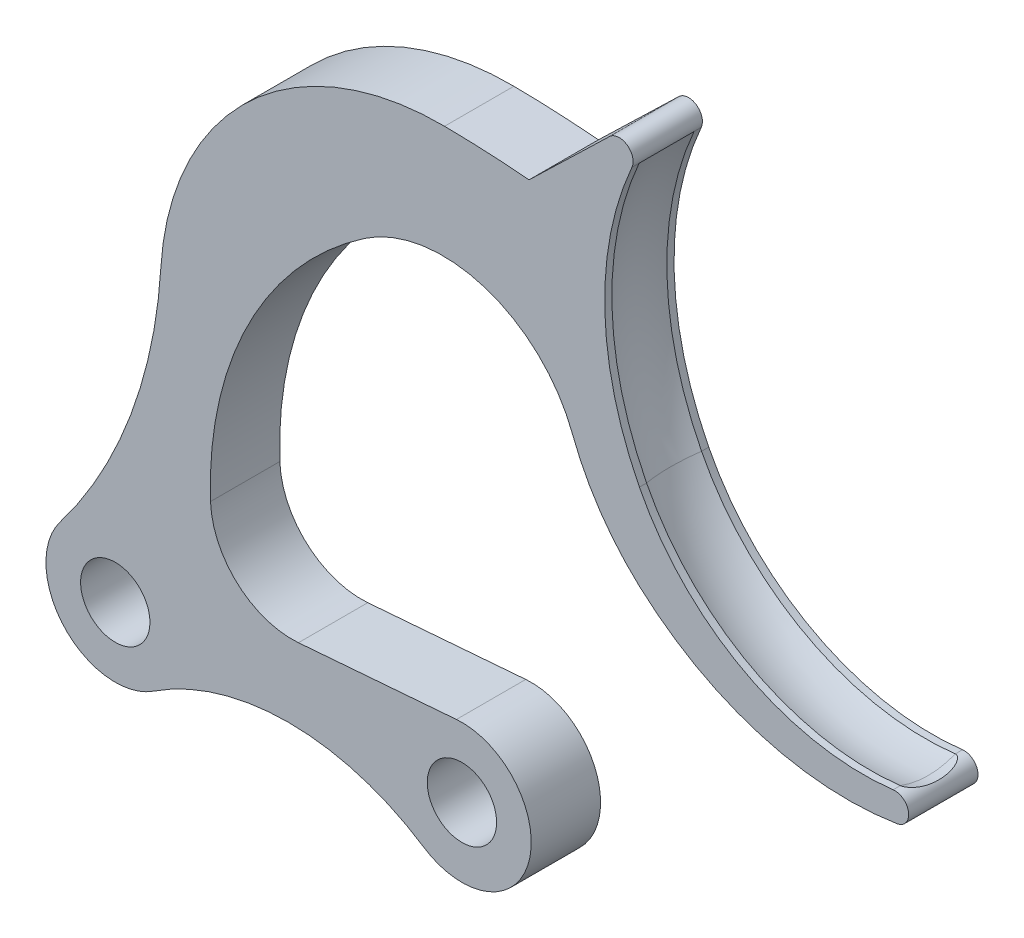
ISO-10303-21;
HEADER;
FILE_DESCRIPTION(('STEP AP214'),'2;1');
FILE_NAME('part.step','',(''),(''),'','','');
FILE_SCHEMA(('AUTOMOTIVE_DESIGN { 1 0 10303 214 1 1 1 1 }'));
ENDSEC;
DATA;
#1=APPLICATION_CONTEXT('core data for automotive mechanical design processes');
#2=APPLICATION_PROTOCOL_DEFINITION('international standard','automotive_design',2000,#1);
#3=PRODUCT_CONTEXT('',#1,'mechanical');
#4=PRODUCT('Part','Part','',(#3));
#5=PRODUCT_RELATED_PRODUCT_CATEGORY('part','',(#4));
#6=PRODUCT_DEFINITION_FORMATION('','',#4);
#7=PRODUCT_DEFINITION_CONTEXT('part definition',#1,'design');
#8=PRODUCT_DEFINITION('design','',#6,#7);
#9=PRODUCT_DEFINITION_SHAPE('','',#8);
#10=(LENGTH_UNIT() NAMED_UNIT(*) SI_UNIT(.MILLI.,.METRE.));
#11=(NAMED_UNIT(*) PLANE_ANGLE_UNIT() SI_UNIT($,.RADIAN.));
#12=(NAMED_UNIT(*) SI_UNIT($,.STERADIAN.) SOLID_ANGLE_UNIT());
#13=UNCERTAINTY_MEASURE_WITH_UNIT(LENGTH_MEASURE(1.E-05),#10,'distance_accuracy_value','');
#14=(GEOMETRIC_REPRESENTATION_CONTEXT(3) GLOBAL_UNCERTAINTY_ASSIGNED_CONTEXT((#13)) GLOBAL_UNIT_ASSIGNED_CONTEXT((#10,
#11,#12)) REPRESENTATION_CONTEXT('',''));
#15=CARTESIAN_POINT('',(0.,0.,0.));
#16=DIRECTION('',(0.,0.,1.));
#17=DIRECTION('',(1.,0.,0.));
#18=AXIS2_PLACEMENT_3D('',#15,#16,#17);
#19=CARTESIAN_POINT('',(58.2226825078013,36.5090543889675,-2.5));
#20=DIRECTION('',(0.,0.,1.));
#21=DIRECTION('',(1.,0.,0.));
#22=AXIS2_PLACEMENT_3D('',#19,#20,#21);
#23=CYLINDRICAL_SURFACE('',#22,22.9272942399541);
#24=DIRECTION('',(0.,0.,1.));
#25=VECTOR('',#24,1.);
#26=CARTESIAN_POINT('',(37.7991681713568,26.0907587839045,-2.5));
#27=LINE('',#26,#25);
#28=CARTESIAN_POINT('',(37.7991681713568,26.0907587839045,1.98204630208392));
#29=VERTEX_POINT('',#28);
#30=CARTESIAN_POINT('',(37.7991681713568,26.0907587839045,2.5));
#31=VERTEX_POINT('',#30);
#32=EDGE_CURVE('E211',#29,#31,#27,.T.);
#33=ORIENTED_EDGE('',*,*,#32,.F.);
#34=CARTESIAN_POINT('',(58.2226825078013,36.5090543889675,1.98204630208393));
#35=DIRECTION('',(0.,0.,-1.));
#36=DIRECTION('',(-1.,0.,0.));
#37=AXIS2_PLACEMENT_3D('',#34,#35,#36);
#38=CIRCLE('',#37,22.9272942399541);
#39=CARTESIAN_POINT('',(37.2578841277003,45.790113059569,1.98204630208393));
#40=VERTEX_POINT('',#39);
#41=EDGE_CURVE('E418',#29,#40,#38,.T.);
#42=ORIENTED_EDGE('',*,*,#41,.T.);
#43=DIRECTION('',(0.,0.,1.));
#44=VECTOR('',#43,1.);
#45=CARTESIAN_POINT('',(37.2578841277003,45.790113059569,-2.5));
#46=LINE('',#45,#44);
#47=CARTESIAN_POINT('',(37.2578841277003,45.790113059569,2.5));
#48=VERTEX_POINT('',#47);
#49=EDGE_CURVE('E398',#40,#48,#46,.T.);
#50=ORIENTED_EDGE('',*,*,#49,.T.);
#51=CARTESIAN_POINT('',(58.2226825078013,36.5090543889675,2.5));
#52=DIRECTION('',(0.,0.,-1.));
#53=DIRECTION('',(1.,0.,0.));
#54=AXIS2_PLACEMENT_3D('',#51,#52,#53);
#55=CIRCLE('',#54,22.9272942399541);
#56=EDGE_CURVE('E390',#31,#48,#55,.T.);
#57=ORIENTED_EDGE('',*,*,#56,.F.);
#58=EDGE_LOOP('',(#33,#42,#50,#57));
#59=FACE_BOUND('',#58,.T.);
#60=ADVANCED_FACE('F38',(#59),#23,.F.);
#61=CARTESIAN_POINT('',(37.2578841277003,45.790113059569,-2.5));
#62=VERTEX_POINT('',#61);
#63=CARTESIAN_POINT('',(37.2578841277003,45.790113059569,-1.98204630208393));
#64=VERTEX_POINT('',#63);
#65=EDGE_CURVE('E395',#62,#64,#46,.T.);
#66=ORIENTED_EDGE('',*,*,#65,.T.);
#67=CARTESIAN_POINT('',(58.2226825078013,36.5090543889675,-1.98204630208393));
#68=DIRECTION('',(0.,0.,1.));
#69=DIRECTION('',(1.,0.,0.));
#70=AXIS2_PLACEMENT_3D('',#67,#68,#69);
#71=CIRCLE('',#70,22.9272942399541);
#72=CARTESIAN_POINT('',(37.7991681713568,26.0907587839045,-1.98204630208392));
#73=VERTEX_POINT('',#72);
#74=EDGE_CURVE('E203',#64,#73,#71,.T.);
#75=ORIENTED_EDGE('',*,*,#74,.T.);
#76=CARTESIAN_POINT('',(37.7991681713568,26.0907587839045,-2.5));
#77=VERTEX_POINT('',#76);
#78=EDGE_CURVE('E215',#77,#73,#27,.T.);
#79=ORIENTED_EDGE('',*,*,#78,.F.);
#80=CARTESIAN_POINT('',(58.2226825078013,36.5090543889675,-2.5));
#81=DIRECTION('',(0.,0.,-1.));
#82=DIRECTION('',(1.,0.,0.));
#83=AXIS2_PLACEMENT_3D('',#80,#81,#82);
#84=CIRCLE('',#83,22.9272942399541);
#85=EDGE_CURVE('E422',#77,#62,#84,.T.);
#86=ORIENTED_EDGE('',*,*,#85,.T.);
#87=EDGE_LOOP('',(#66,#75,#79,#86));
#88=FACE_BOUND('',#87,.T.);
#89=ADVANCED_FACE('F337',(#88),#23,.F.);
#90=CARTESIAN_POINT('',(53.9314135044685,34.3200232427565,-2.5));
#91=DIRECTION('',(0.,0.,1.));
#92=DIRECTION('',(1.,0.,0.));
#93=AXIS2_PLACEMENT_3D('',#90,#91,#92);
#94=CYLINDRICAL_SURFACE('',#93,18.1099456934975);
#95=DIRECTION('',(0.,0.,1.));
#96=VECTOR('',#95,1.);
#97=CARTESIAN_POINT('',(56.0998806077633,16.3403713149978,-2.5));
#98=LINE('',#97,#96);
#99=CARTESIAN_POINT('',(56.0998806077633,16.3403713149978,1.98204630208393));
#100=VERTEX_POINT('',#99);
#101=CARTESIAN_POINT('',(56.0998806077633,16.3403713149978,2.5));
#102=VERTEX_POINT('',#101);
#103=EDGE_CURVE('E190',#100,#102,#98,.T.);
#104=ORIENTED_EDGE('',*,*,#103,.F.);
#105=CARTESIAN_POINT('',(53.9314135044685,34.3200232427565,1.98204630208392));
#106=DIRECTION('',(0.,0.,-1.));
#107=DIRECTION('',(-1.,0.,0.));
#108=AXIS2_PLACEMENT_3D('',#105,#106,#107);
#109=CIRCLE('',#108,18.1099456934975);
#110=EDGE_CURVE('E198',#100,#29,#109,.T.);
#111=ORIENTED_EDGE('',*,*,#110,.T.);
#112=ORIENTED_EDGE('',*,*,#32,.T.);
#113=CARTESIAN_POINT('',(53.9314135044685,34.3200232427565,2.5));
#114=DIRECTION('',(0.,0.,-1.));
#115=DIRECTION('',(1.,0.,0.));
#116=AXIS2_PLACEMENT_3D('',#113,#114,#115);
#117=CIRCLE('',#116,18.1099456934975);
#118=EDGE_CURVE('E207',#102,#31,#117,.T.);
#119=ORIENTED_EDGE('',*,*,#118,.F.);
#120=EDGE_LOOP('',(#104,#111,#112,#119));
#121=FACE_BOUND('',#120,.T.);
#122=ADVANCED_FACE('F205',(#121),#94,.F.);
#123=ORIENTED_EDGE('',*,*,#78,.T.);
#124=CARTESIAN_POINT('',(53.9314135044685,34.3200232427565,-1.98204630208392));
#125=DIRECTION('',(0.,0.,1.));
#126=DIRECTION('',(1.,0.,0.));
#127=AXIS2_PLACEMENT_3D('',#124,#125,#126);
#128=CIRCLE('',#127,18.1099456934975);
#129=CARTESIAN_POINT('',(56.0998806077633,16.3403713149978,-1.98204630208393));
#130=VERTEX_POINT('',#129);
#131=EDGE_CURVE('E182',#73,#130,#128,.T.);
#132=ORIENTED_EDGE('',*,*,#131,.T.);
#133=CARTESIAN_POINT('',(56.0998806077633,16.3403713149978,-2.5));
#134=VERTEX_POINT('',#133);
#135=EDGE_CURVE('E193',#134,#130,#98,.T.);
#136=ORIENTED_EDGE('',*,*,#135,.F.);
#137=CARTESIAN_POINT('',(53.9314135044685,34.3200232427565,-2.5));
#138=DIRECTION('',(0.,0.,-1.));
#139=DIRECTION('',(1.,0.,0.));
#140=AXIS2_PLACEMENT_3D('',#137,#138,#139);
#141=CIRCLE('',#140,18.1099456934975);
#142=EDGE_CURVE('E424',#134,#77,#141,.T.);
#143=ORIENTED_EDGE('',*,*,#142,.T.);
#144=EDGE_LOOP('',(#123,#132,#136,#143));
#145=FACE_BOUND('',#144,.T.);
#146=ADVANCED_FACE('F350',(#145),#94,.F.);
#147=CARTESIAN_POINT('',(0.,0.,2.5));
#148=DIRECTION('',(0.,0.,1.));
#149=DIRECTION('',(1.,0.,0.));
#150=AXIS2_PLACEMENT_3D('',#147,#148,#149);
#151=PLANE('',#150);
#152=CARTESIAN_POINT('',(25.,0.,2.5));
#153=DIRECTION('',(0.,0.,1.));
#154=DIRECTION('',(1.,0.,0.));
#155=AXIS2_PLACEMENT_3D('',#152,#153,#154);
#156=CIRCLE('',#155,2.5);
#157=CARTESIAN_POINT('',(27.5,0.,2.5));
#158=VERTEX_POINT('',#157);
#159=EDGE_CURVE('E289',#158,#158,#156,.T.);
#160=ORIENTED_EDGE('',*,*,#159,.F.);
#161=EDGE_LOOP('',(#160));
#162=FACE_BOUND('',#161,.T.);
#163=CARTESIAN_POINT('',(0.,0.,2.5));
#164=DIRECTION('',(0.,0.,1.));
#165=DIRECTION('',(1.,0.,0.));
#166=AXIS2_PLACEMENT_3D('',#163,#164,#165);
#167=CIRCLE('',#166,2.5);
#168=CARTESIAN_POINT('',(2.5,0.,2.5));
#169=VERTEX_POINT('',#168);
#170=EDGE_CURVE('E283',#169,#169,#167,.T.);
#171=ORIENTED_EDGE('',*,*,#170,.F.);
#172=EDGE_LOOP('',(#171));
#173=FACE_BOUND('',#172,.T.);
#174=CARTESIAN_POINT('',(25.,0.,2.5));
#175=DIRECTION('',(0.,0.,1.));
#176=DIRECTION('',(1.,0.,0.));
#177=AXIS2_PLACEMENT_3D('',#174,#175,#176);
#178=CIRCLE('',#177,5.);
#179=CARTESIAN_POINT('',(22.2497709928489,-4.17567244982466,2.5));
#180=VERTEX_POINT('',#179);
#181=CARTESIAN_POINT('',(24.6042547545765,4.98431396490277,2.5));
#182=VERTEX_POINT('',#181);
#183=EDGE_CURVE('E297',#180,#182,#178,.T.);
#184=ORIENTED_EDGE('',*,*,#183,.T.);
#185=DIRECTION('',(-0.996862792980552,-0.0791490490847025,0.));
#186=VECTOR('',#185,1.);
#187=CARTESIAN_POINT('',(13.2101842834548,4.079645991192,2.5));
#188=LINE('',#187,#186);
#189=CARTESIAN_POINT('',(13.2101842834548,4.07964599119199,2.5));
#190=VERTEX_POINT('',#189);
#191=EDGE_CURVE('E250',#182,#190,#188,.T.);
#192=ORIENTED_EDGE('',*,*,#191,.T.);
#193=CARTESIAN_POINT('',(12.7448377193228,9.9405714348829,2.5));
#194=DIRECTION('',(0.,0.,-1.));
#195=DIRECTION('',(1.,0.,0.));
#196=AXIS2_PLACEMENT_3D('',#193,#194,#195);
#197=CIRCLE('',#196,5.87937024529438);
#198=CARTESIAN_POINT('',(6.86933476984612,9.72735893069197,2.5));
#199=VERTEX_POINT('',#198);
#200=EDGE_CURVE('E253',#190,#199,#197,.T.);
#201=ORIENTED_EDGE('',*,*,#200,.T.);
#202=CARTESIAN_POINT('',(32.353978900582,10.6521554698567,2.5));
#203=DIRECTION('',(0.,0.,-1.));
#204=DIRECTION('',(-1.,0.,0.));
#205=AXIS2_PLACEMENT_3D('',#202,#203,#204);
#206=CIRCLE('',#205,25.5014182960301);
#207=CARTESIAN_POINT('',(17.9857844126222,31.7205517606346,2.5));
#208=VERTEX_POINT('',#207);
#209=EDGE_CURVE('E256',#199,#208,#206,.T.);
#210=ORIENTED_EDGE('',*,*,#209,.T.);
#211=CARTESIAN_POINT('',(23.6200571111711,23.4588950769914,2.5));
#212=DIRECTION('',(0.,0.,1.));
#213=DIRECTION('',(1.,0.,0.));
#214=AXIS2_PLACEMENT_3D('',#211,#212,#213);
#215=CIRCLE('',#214,10.);
#216=CARTESIAN_POINT('',(32.9709637978927,27.0029808739529,2.5));
#217=VERTEX_POINT('',#216);
#218=EDGE_CURVE('E46',#208,#217,#215,.F.);
#219=ORIENTED_EDGE('',*,*,#218,.T.);
#220=CARTESIAN_POINT('',(50.2240589299429,33.5420739757967,2.5));
#221=DIRECTION('',(0.,0.,1.));
#222=DIRECTION('',(1.,0.,0.));
#223=AXIS2_PLACEMENT_3D('',#220,#221,#222);
#224=CIRCLE('',#223,18.4507189624187);
#225=CARTESIAN_POINT('',(37.7991681713567,19.9020182622977,2.5));
#226=VERTEX_POINT('',#225);
#227=EDGE_CURVE('E416',#217,#226,#224,.T.);
#228=ORIENTED_EDGE('',*,*,#227,.T.);
#229=CARTESIAN_POINT('',(52.8405731795773,36.4144855594167,2.5));
#230=DIRECTION('',(0.,0.,1.));
#231=DIRECTION('',(1.,0.,0.));
#232=AXIS2_PLACEMENT_3D('',#229,#230,#231);
#233=CIRCLE('',#232,22.3361912791717);
#234=CARTESIAN_POINT('',(56.3779912109044,14.3601863293032,2.5));
#235=VERTEX_POINT('',#234);
#236=EDGE_CURVE('E412',#226,#235,#233,.T.);
#237=ORIENTED_EDGE('',*,*,#236,.T.);
#238=CARTESIAN_POINT('',(56.2196196252068,15.3475659122618,2.5));
#239=DIRECTION('',(0.,0.,1.));
#240=DIRECTION('',(-1.,0.,0.));
#241=AXIS2_PLACEMENT_3D('',#238,#239,#240);
#242=CIRCLE('',#241,0.999999999999997);
#243=EDGE_CURVE('E410',#235,#102,#242,.T.);
#244=ORIENTED_EDGE('',*,*,#243,.T.);
#245=ORIENTED_EDGE('',*,*,#118,.T.);
#246=ORIENTED_EDGE('',*,*,#56,.T.);
#247=CARTESIAN_POINT('',(36.3434806154199,46.1949169833756,2.5));
#248=DIRECTION('',(0.,0.,1.));
#249=DIRECTION('',(-1.,0.,0.));
#250=AXIS2_PLACEMENT_3D('',#247,#248,#249);
#251=CIRCLE('',#250,1.);
#252=CARTESIAN_POINT('',(35.648712262663,46.9141505587928,2.5));
#253=VERTEX_POINT('',#252);
#254=EDGE_CURVE('E386',#48,#253,#251,.T.);
#255=ORIENTED_EDGE('',*,*,#254,.T.);
#256=DIRECTION('',(-0.719233575417234,-0.694768352756904,0.));
#257=VECTOR('',#256,1.);
#258=CARTESIAN_POINT('',(29.8436703148365,41.3065710886096,2.5));
#259=LINE('',#258,#257);
#260=CARTESIAN_POINT('',(29.8436703148365,41.3065710886096,2.5));
#261=VERTEX_POINT('',#260);
#262=EDGE_CURVE('E380',#253,#261,#259,.T.);
#263=ORIENTED_EDGE('',*,*,#262,.T.);
#264=CARTESIAN_POINT('',(22.9439482129142,-37.444832821864,2.5));
#265=DIRECTION('',(0.,0.,1.));
#266=DIRECTION('',(-1.,0.,0.));
#267=AXIS2_PLACEMENT_3D('',#264,#265,#266);
#268=CIRCLE('',#267,79.0530820585404);
#269=CARTESIAN_POINT('',(23.7481849093968,41.6041582298271,2.5));
#270=VERTEX_POINT('',#269);
#271=EDGE_CURVE('E258',#261,#270,#268,.T.);
#272=ORIENTED_EDGE('',*,*,#271,.T.);
#273=CARTESIAN_POINT('',(23.5417487744683,21.3134052039131,2.5));
#274=DIRECTION('',(0.,0.,1.));
#275=DIRECTION('',(-1.,0.,0.));
#276=AXIS2_PLACEMENT_3D('',#273,#274,#275);
#277=CIRCLE('',#276,20.291803129255);
#278=CARTESIAN_POINT('',(3.28714861794059,22.5415935997336,2.5));
#279=VERTEX_POINT('',#278);
#280=EDGE_CURVE('E225',#270,#279,#277,.T.);
#281=ORIENTED_EDGE('',*,*,#280,.T.);
#282=CARTESIAN_POINT('',(-32.3525928679536,24.702698562791,2.5));
#283=DIRECTION('',(0.,0.,-1.));
#284=DIRECTION('',(-1.,0.,0.));
#285=AXIS2_PLACEMENT_3D('',#282,#283,#284);
#286=CIRCLE('',#285,35.7052033720958);
#287=CARTESIAN_POINT('',(-3.97401194292178,3.03434162175506,2.5));
#288=VERTEX_POINT('',#287);
#289=EDGE_CURVE('E243',#279,#288,#286,.T.);
#290=ORIENTED_EDGE('',*,*,#289,.T.);
#291=CARTESIAN_POINT('',(0.,0.,2.5));
#292=DIRECTION('',(0.,0.,1.));
#293=DIRECTION('',(1.,0.,0.));
#294=AXIS2_PLACEMENT_3D('',#291,#292,#293);
#295=CIRCLE('',#294,5.);
#296=CARTESIAN_POINT('',(2.75022900715111,-4.17567244982466,2.5));
#297=VERTEX_POINT('',#296);
#298=EDGE_CURVE('E295',#288,#297,#295,.T.);
#299=ORIENTED_EDGE('',*,*,#298,.T.);
#300=CARTESIAN_POINT('',(12.5,-18.9787488558549,2.5));
#301=DIRECTION('',(0.,0.,-1.));
#302=DIRECTION('',(-1.,0.,0.));
#303=AXIS2_PLACEMENT_3D('',#300,#301,#302);
#304=CIRCLE('',#303,17.7253802637847);
#305=EDGE_CURVE('E246',#297,#180,#304,.T.);
#306=ORIENTED_EDGE('',*,*,#305,.T.);
#307=EDGE_LOOP('',(#184,#192,#201,#210,#219,#228,#237,#244,#245,#246,#255,#263,#272,#281,#290,
#299,#306));
#308=FACE_BOUND('',#307,.T.);
#309=ADVANCED_FACE('F312',(#162,#173,#308),#151,.T.);
#310=CARTESIAN_POINT('',(0.,0.,-2.5));
#311=DIRECTION('',(0.,0.,1.));
#312=DIRECTION('',(1.,0.,0.));
#313=AXIS2_PLACEMENT_3D('',#310,#311,#312);
#314=PLANE('',#313);
#315=CARTESIAN_POINT('',(25.,0.,-2.5));
#316=DIRECTION('',(0.,0.,1.));
#317=DIRECTION('',(1.,0.,0.));
#318=AXIS2_PLACEMENT_3D('',#315,#316,#317);
#319=CIRCLE('',#318,2.5);
#320=CARTESIAN_POINT('',(27.5,0.,-2.5));
#321=VERTEX_POINT('',#320);
#322=EDGE_CURVE('E286',#321,#321,#319,.T.);
#323=ORIENTED_EDGE('',*,*,#322,.T.);
#324=EDGE_LOOP('',(#323));
#325=FACE_BOUND('',#324,.T.);
#326=CARTESIAN_POINT('',(0.,0.,-2.5));
#327=DIRECTION('',(0.,0.,1.));
#328=DIRECTION('',(1.,0.,0.));
#329=AXIS2_PLACEMENT_3D('',#326,#327,#328);
#330=CIRCLE('',#329,2.5);
#331=CARTESIAN_POINT('',(2.5,0.,-2.5));
#332=VERTEX_POINT('',#331);
#333=EDGE_CURVE('E264',#332,#332,#330,.T.);
#334=ORIENTED_EDGE('',*,*,#333,.T.);
#335=EDGE_LOOP('',(#334));
#336=FACE_BOUND('',#335,.T.);
#337=DIRECTION('',(-0.996862792980552,-0.0791490490847025,0.));
#338=VECTOR('',#337,1.);
#339=CARTESIAN_POINT('',(13.2101842834548,4.079645991192,-2.5));
#340=LINE('',#339,#338);
#341=CARTESIAN_POINT('',(24.6042547545765,4.98431396490277,-2.5));
#342=VERTEX_POINT('',#341);
#343=CARTESIAN_POINT('',(13.2101842834548,4.07964599119199,-2.5));
#344=VERTEX_POINT('',#343);
#345=EDGE_CURVE('E228',#342,#344,#340,.T.);
#346=ORIENTED_EDGE('',*,*,#345,.F.);
#347=CARTESIAN_POINT('',(25.,0.,-2.5));
#348=DIRECTION('',(0.,0.,1.));
#349=DIRECTION('',(1.,0.,0.));
#350=AXIS2_PLACEMENT_3D('',#347,#348,#349);
#351=CIRCLE('',#350,5.);
#352=CARTESIAN_POINT('',(22.2497709928489,-4.17567244982466,-2.5));
#353=VERTEX_POINT('',#352);
#354=EDGE_CURVE('E298',#353,#342,#351,.T.);
#355=ORIENTED_EDGE('',*,*,#354,.F.);
#356=CARTESIAN_POINT('',(12.5,-18.9787488558549,-2.5));
#357=DIRECTION('',(0.,0.,-1.));
#358=DIRECTION('',(-1.,0.,0.));
#359=AXIS2_PLACEMENT_3D('',#356,#357,#358);
#360=CIRCLE('',#359,17.7253802637847);
#361=CARTESIAN_POINT('',(2.75022900715111,-4.17567244982466,-2.5));
#362=VERTEX_POINT('',#361);
#363=EDGE_CURVE('E224',#362,#353,#360,.T.);
#364=ORIENTED_EDGE('',*,*,#363,.F.);
#365=CARTESIAN_POINT('',(0.,0.,-2.5));
#366=DIRECTION('',(0.,0.,1.));
#367=DIRECTION('',(1.,0.,0.));
#368=AXIS2_PLACEMENT_3D('',#365,#366,#367);
#369=CIRCLE('',#368,5.);
#370=CARTESIAN_POINT('',(-3.97401194292178,3.03434162175506,-2.5));
#371=VERTEX_POINT('',#370);
#372=EDGE_CURVE('E292',#371,#362,#369,.T.);
#373=ORIENTED_EDGE('',*,*,#372,.F.);
#374=CARTESIAN_POINT('',(-32.3525928679536,24.702698562791,-2.5));
#375=DIRECTION('',(0.,0.,-1.));
#376=DIRECTION('',(-1.,0.,0.));
#377=AXIS2_PLACEMENT_3D('',#374,#375,#376);
#378=CIRCLE('',#377,35.7052033720958);
#379=CARTESIAN_POINT('',(3.28714861794059,22.5415935997336,-2.5));
#380=VERTEX_POINT('',#379);
#381=EDGE_CURVE('E221',#380,#371,#378,.T.);
#382=ORIENTED_EDGE('',*,*,#381,.F.);
#383=CARTESIAN_POINT('',(23.5417487744683,21.3134052039131,-2.5));
#384=DIRECTION('',(0.,0.,1.));
#385=DIRECTION('',(-1.,0.,0.));
#386=AXIS2_PLACEMENT_3D('',#383,#384,#385);
#387=CIRCLE('',#386,20.291803129255);
#388=CARTESIAN_POINT('',(23.7481849093968,41.6041582298271,-2.5));
#389=VERTEX_POINT('',#388);
#390=EDGE_CURVE('E239',#389,#380,#387,.T.);
#391=ORIENTED_EDGE('',*,*,#390,.F.);
#392=CARTESIAN_POINT('',(22.9439482129142,-37.444832821864,-2.5));
#393=DIRECTION('',(0.,0.,1.));
#394=DIRECTION('',(-1.,0.,0.));
#395=AXIS2_PLACEMENT_3D('',#392,#393,#394);
#396=CIRCLE('',#395,79.0530820585404);
#397=CARTESIAN_POINT('',(29.8436703148365,41.3065710886096,-2.5));
#398=VERTEX_POINT('',#397);
#399=EDGE_CURVE('E237',#398,#389,#396,.T.);
#400=ORIENTED_EDGE('',*,*,#399,.F.);
#401=DIRECTION('',(-0.719233575417234,-0.694768352756904,0.));
#402=VECTOR('',#401,1.);
#403=CARTESIAN_POINT('',(29.8436703148365,41.3065710886096,-2.5));
#404=LINE('',#403,#402);
#405=CARTESIAN_POINT('',(35.648712262663,46.9141505587928,-2.5));
#406=VERTEX_POINT('',#405);
#407=EDGE_CURVE('E220',#406,#398,#404,.T.);
#408=ORIENTED_EDGE('',*,*,#407,.F.);
#409=CARTESIAN_POINT('',(36.3434806154199,46.1949169833756,-2.5));
#410=DIRECTION('',(0.,0.,1.));
#411=DIRECTION('',(-1.,0.,0.));
#412=AXIS2_PLACEMENT_3D('',#409,#410,#411);
#413=CIRCLE('',#412,1.);
#414=EDGE_CURVE('E420',#62,#406,#413,.T.);
#415=ORIENTED_EDGE('',*,*,#414,.F.);
#416=ORIENTED_EDGE('',*,*,#85,.F.);
#417=ORIENTED_EDGE('',*,*,#142,.F.);
#418=CARTESIAN_POINT('',(56.2196196252068,15.3475659122618,-2.5));
#419=DIRECTION('',(0.,0.,1.));
#420=DIRECTION('',(-1.,0.,0.));
#421=AXIS2_PLACEMENT_3D('',#418,#419,#420);
#422=CIRCLE('',#421,0.999999999999997);
#423=CARTESIAN_POINT('',(56.3779912109044,14.3601863293032,-2.5));
#424=VERTEX_POINT('',#423);
#425=EDGE_CURVE('E426',#424,#134,#422,.T.);
#426=ORIENTED_EDGE('',*,*,#425,.F.);
#427=CARTESIAN_POINT('',(52.8405731795773,36.4144855594167,-2.5));
#428=DIRECTION('',(0.,0.,1.));
#429=DIRECTION('',(1.,0.,0.));
#430=AXIS2_PLACEMENT_3D('',#427,#428,#429);
#431=CIRCLE('',#430,22.3361912791717);
#432=CARTESIAN_POINT('',(37.7991681713567,19.9020182622977,-2.5));
#433=VERTEX_POINT('',#432);
#434=EDGE_CURVE('E388',#433,#424,#431,.T.);
#435=ORIENTED_EDGE('',*,*,#434,.F.);
#436=CARTESIAN_POINT('',(50.2240589299429,33.5420739757967,-2.5));
#437=DIRECTION('',(0.,0.,1.));
#438=DIRECTION('',(1.,0.,0.));
#439=AXIS2_PLACEMENT_3D('',#436,#437,#438);
#440=CIRCLE('',#439,18.4507189624187);
#441=CARTESIAN_POINT('',(32.9709637978927,27.0029808739529,-2.5));
#442=VERTEX_POINT('',#441);
#443=EDGE_CURVE('E322',#442,#433,#440,.T.);
#444=ORIENTED_EDGE('',*,*,#443,.F.);
#445=CARTESIAN_POINT('',(23.6200571111711,23.4588950769914,-2.5));
#446=DIRECTION('',(0.,0.,1.));
#447=DIRECTION('',(1.,0.,0.));
#448=AXIS2_PLACEMENT_3D('',#445,#446,#447);
#449=CIRCLE('',#448,10.);
#450=CARTESIAN_POINT('',(17.9857844126222,31.7205517606346,-2.5));
#451=VERTEX_POINT('',#450);
#452=EDGE_CURVE('E12',#442,#451,#449,.T.);
#453=ORIENTED_EDGE('',*,*,#452,.T.);
#454=CARTESIAN_POINT('',(32.353978900582,10.6521554698567,-2.5));
#455=DIRECTION('',(0.,0.,-1.));
#456=DIRECTION('',(-1.,0.,0.));
#457=AXIS2_PLACEMENT_3D('',#454,#455,#456);
#458=CIRCLE('',#457,25.5014182960301);
#459=CARTESIAN_POINT('',(6.86933476984612,9.72735893069197,-2.5));
#460=VERTEX_POINT('',#459);
#461=EDGE_CURVE('E234',#460,#451,#458,.T.);
#462=ORIENTED_EDGE('',*,*,#461,.F.);
#463=CARTESIAN_POINT('',(12.7448377193228,9.9405714348829,-2.5));
#464=DIRECTION('',(0.,0.,-1.));
#465=DIRECTION('',(1.,0.,0.));
#466=AXIS2_PLACEMENT_3D('',#463,#464,#465);
#467=CIRCLE('',#466,5.87937024529438);
#468=EDGE_CURVE('E231',#344,#460,#467,.T.);
#469=ORIENTED_EDGE('',*,*,#468,.F.);
#470=EDGE_LOOP('',(#346,#355,#364,#373,#382,#391,#400,#408,#415,#416,#417,#426,#435,#444,#453,
#462,#469));
#471=FACE_BOUND('',#470,.T.);
#472=ADVANCED_FACE('F320',(#325,#336,#471),#314,.F.);
#473=CARTESIAN_POINT('',(0.,0.,2.5));
#474=DIRECTION('',(0.,0.,-1.));
#475=DIRECTION('',(-1.,0.,0.));
#476=AXIS2_PLACEMENT_3D('',#473,#474,#475);
#477=CYLINDRICAL_SURFACE('',#476,5.);
#478=ORIENTED_EDGE('',*,*,#372,.T.);
#479=DIRECTION('',(0.,0.,1.));
#480=VECTOR('',#479,1.);
#481=CARTESIAN_POINT('',(2.75022900715111,-4.17567244982466,-2.5));
#482=LINE('',#481,#480);
#483=EDGE_CURVE('E278',#362,#297,#482,.T.);
#484=ORIENTED_EDGE('',*,*,#483,.T.);
#485=ORIENTED_EDGE('',*,*,#298,.F.);
#486=DIRECTION('',(0.,0.,1.));
#487=VECTOR('',#486,1.);
#488=CARTESIAN_POINT('',(-3.97401194292178,3.03434162175506,-2.5));
#489=LINE('',#488,#487);
#490=EDGE_CURVE('E242',#371,#288,#489,.T.);
#491=ORIENTED_EDGE('',*,*,#490,.F.);
#492=EDGE_LOOP('',(#478,#484,#485,#491));
#493=FACE_BOUND('',#492,.T.);
#494=ADVANCED_FACE('F452',(#493),#477,.T.);
#495=CARTESIAN_POINT('',(25.,0.,2.5));
#496=DIRECTION('',(0.,0.,-1.));
#497=DIRECTION('',(-1.,0.,0.));
#498=AXIS2_PLACEMENT_3D('',#495,#496,#497);
#499=CYLINDRICAL_SURFACE('',#498,5.);
#500=ORIENTED_EDGE('',*,*,#354,.T.);
#501=DIRECTION('',(0.,0.,1.));
#502=VECTOR('',#501,1.);
#503=CARTESIAN_POINT('',(24.6042547545765,4.98431396490277,-2.5));
#504=LINE('',#503,#502);
#505=EDGE_CURVE('E272',#342,#182,#504,.T.);
#506=ORIENTED_EDGE('',*,*,#505,.T.);
#507=ORIENTED_EDGE('',*,*,#183,.F.);
#508=DIRECTION('',(0.,0.,1.));
#509=VECTOR('',#508,1.);
#510=CARTESIAN_POINT('',(22.2497709928489,-4.17567244982466,-2.5));
#511=LINE('',#510,#509);
#512=EDGE_CURVE('E275',#353,#180,#511,.T.);
#513=ORIENTED_EDGE('',*,*,#512,.F.);
#514=EDGE_LOOP('',(#500,#506,#507,#513));
#515=FACE_BOUND('',#514,.T.);
#516=ADVANCED_FACE('F458',(#515),#499,.T.);
#517=CARTESIAN_POINT('',(25.,0.,2.5));
#518=DIRECTION('',(0.,0.,-1.));
#519=DIRECTION('',(-1.,0.,0.));
#520=AXIS2_PLACEMENT_3D('',#517,#518,#519);
#521=CYLINDRICAL_SURFACE('',#520,2.5);
#522=ORIENTED_EDGE('',*,*,#159,.T.);
#523=EDGE_LOOP('',(#522));
#524=FACE_BOUND('',#523,.T.);
#525=ORIENTED_EDGE('',*,*,#322,.F.);
#526=EDGE_LOOP('',(#525));
#527=FACE_BOUND('',#526,.T.);
#528=ADVANCED_FACE('F470',(#524,#527),#521,.F.);
#529=CARTESIAN_POINT('',(0.,0.,2.5));
#530=DIRECTION('',(0.,0.,-1.));
#531=DIRECTION('',(-1.,0.,0.));
#532=AXIS2_PLACEMENT_3D('',#529,#530,#531);
#533=CYLINDRICAL_SURFACE('',#532,2.5);
#534=ORIENTED_EDGE('',*,*,#170,.T.);
#535=EDGE_LOOP('',(#534));
#536=FACE_BOUND('',#535,.T.);
#537=ORIENTED_EDGE('',*,*,#333,.F.);
#538=EDGE_LOOP('',(#537));
#539=FACE_BOUND('',#538,.T.);
#540=ADVANCED_FACE('F463',(#536,#539),#533,.F.);
#541=CARTESIAN_POINT('',(13.2101842834548,4.079645991192,-2.5));
#542=DIRECTION('',(-0.0791490490847025,0.996862792980552,0.));
#543=DIRECTION('',(-0.996862792980552,-0.0791490490847025,0.));
#544=AXIS2_PLACEMENT_3D('',#541,#542,#543);
#545=PLANE('',#544);
#546=ORIENTED_EDGE('',*,*,#191,.F.);
#547=ORIENTED_EDGE('',*,*,#505,.F.);
#548=ORIENTED_EDGE('',*,*,#345,.T.);
#549=DIRECTION('',(0.,0.,1.));
#550=VECTOR('',#549,1.);
#551=CARTESIAN_POINT('',(13.2101842834548,4.07964599119199,-2.5));
#552=LINE('',#551,#550);
#553=EDGE_CURVE('E270',#344,#190,#552,.T.);
#554=ORIENTED_EDGE('',*,*,#553,.T.);
#555=EDGE_LOOP('',(#546,#547,#548,#554));
#556=FACE_BOUND('',#555,.T.);
#557=ADVANCED_FACE('F461',(#556),#545,.T.);
#558=CARTESIAN_POINT('',(12.7448377193228,9.9405714348829,-2.5));
#559=DIRECTION('',(0.,0.,1.));
#560=DIRECTION('',(1.,0.,0.));
#561=AXIS2_PLACEMENT_3D('',#558,#559,#560);
#562=CYLINDRICAL_SURFACE('',#561,5.87937024529438);
#563=ORIENTED_EDGE('',*,*,#200,.F.);
#564=ORIENTED_EDGE('',*,*,#553,.F.);
#565=ORIENTED_EDGE('',*,*,#468,.T.);
#566=DIRECTION('',(0.,0.,1.));
#567=VECTOR('',#566,1.);
#568=CARTESIAN_POINT('',(6.86933476984612,9.72735893069197,-2.5));
#569=LINE('',#568,#567);
#570=EDGE_CURVE('E268',#460,#199,#569,.T.);
#571=ORIENTED_EDGE('',*,*,#570,.T.);
#572=EDGE_LOOP('',(#563,#564,#565,#571));
#573=FACE_BOUND('',#572,.T.);
#574=ADVANCED_FACE('F316',(#573),#562,.F.);
#575=CARTESIAN_POINT('',(32.353978900582,10.6521554698567,-2.5));
#576=DIRECTION('',(0.,0.,1.));
#577=DIRECTION('',(1.,0.,0.));
#578=AXIS2_PLACEMENT_3D('',#575,#576,#577);
#579=CYLINDRICAL_SURFACE('',#578,25.5014182960301);
#580=ORIENTED_EDGE('',*,*,#461,.T.);
#581=DIRECTION('',(0.,0.,1.));
#582=VECTOR('',#581,1.);
#583=CARTESIAN_POINT('',(17.9857844126222,31.7205517606346,-2.5));
#584=LINE('',#583,#582);
#585=EDGE_CURVE('E300',#451,#208,#584,.T.);
#586=ORIENTED_EDGE('',*,*,#585,.T.);
#587=ORIENTED_EDGE('',*,*,#209,.F.);
#588=ORIENTED_EDGE('',*,*,#570,.F.);
#589=EDGE_LOOP('',(#580,#586,#587,#588));
#590=FACE_BOUND('',#589,.T.);
#591=ADVANCED_FACE('F308',(#590),#579,.F.);
#592=CARTESIAN_POINT('',(22.9439482129142,-37.444832821864,-2.5));
#593=DIRECTION('',(0.,0.,1.));
#594=DIRECTION('',(1.,0.,0.));
#595=AXIS2_PLACEMENT_3D('',#592,#593,#594);
#596=CYLINDRICAL_SURFACE('',#595,79.0530820585404);
#597=DIRECTION('',(0.,0.,1.));
#598=VECTOR('',#597,1.);
#599=CARTESIAN_POINT('',(29.8436703148365,41.3065710886096,-2.5));
#600=LINE('',#599,#598);
#601=EDGE_CURVE('E247',#398,#261,#600,.T.);
#602=ORIENTED_EDGE('',*,*,#601,.F.);
#603=ORIENTED_EDGE('',*,*,#399,.T.);
#604=DIRECTION('',(0.,0.,1.));
#605=VECTOR('',#604,1.);
#606=CARTESIAN_POINT('',(23.7481849093968,41.6041582298271,-2.5));
#607=LINE('',#606,#605);
#608=EDGE_CURVE('E265',#389,#270,#607,.T.);
#609=ORIENTED_EDGE('',*,*,#608,.T.);
#610=ORIENTED_EDGE('',*,*,#271,.F.);
#611=EDGE_LOOP('',(#602,#603,#609,#610));
#612=FACE_BOUND('',#611,.T.);
#613=ADVANCED_FACE('F442',(#612),#596,.T.);
#614=CARTESIAN_POINT('',(23.5417487744683,21.3134052039131,-2.5));
#615=DIRECTION('',(0.,0.,1.));
#616=DIRECTION('',(1.,0.,0.));
#617=AXIS2_PLACEMENT_3D('',#614,#615,#616);
#618=CYLINDRICAL_SURFACE('',#617,20.291803129255);
#619=ORIENTED_EDGE('',*,*,#280,.F.);
#620=ORIENTED_EDGE('',*,*,#608,.F.);
#621=ORIENTED_EDGE('',*,*,#390,.T.);
#622=DIRECTION('',(0.,0.,1.));
#623=VECTOR('',#622,1.);
#624=CARTESIAN_POINT('',(3.28714861794059,22.5415935997336,-2.5));
#625=LINE('',#624,#623);
#626=EDGE_CURVE('E262',#380,#279,#625,.T.);
#627=ORIENTED_EDGE('',*,*,#626,.T.);
#628=EDGE_LOOP('',(#619,#620,#621,#627));
#629=FACE_BOUND('',#628,.T.);
#630=ADVANCED_FACE('F447',(#629),#618,.T.);
#631=CARTESIAN_POINT('',(-32.3525928679536,24.702698562791,-2.5));
#632=DIRECTION('',(0.,0.,1.));
#633=DIRECTION('',(1.,0.,0.));
#634=AXIS2_PLACEMENT_3D('',#631,#632,#633);
#635=CYLINDRICAL_SURFACE('',#634,35.7052033720958);
#636=ORIENTED_EDGE('',*,*,#289,.F.);
#637=ORIENTED_EDGE('',*,*,#626,.F.);
#638=ORIENTED_EDGE('',*,*,#381,.T.);
#639=ORIENTED_EDGE('',*,*,#490,.T.);
#640=EDGE_LOOP('',(#636,#637,#638,#639));
#641=FACE_BOUND('',#640,.T.);
#642=ADVANCED_FACE('F375',(#641),#635,.F.);
#643=CARTESIAN_POINT('',(12.5,-18.9787488558549,-2.5));
#644=DIRECTION('',(0.,0.,1.));
#645=DIRECTION('',(1.,0.,0.));
#646=AXIS2_PLACEMENT_3D('',#643,#644,#645);
#647=CYLINDRICAL_SURFACE('',#646,17.7253802637847);
#648=ORIENTED_EDGE('',*,*,#305,.F.);
#649=ORIENTED_EDGE('',*,*,#483,.F.);
#650=ORIENTED_EDGE('',*,*,#363,.T.);
#651=ORIENTED_EDGE('',*,*,#512,.T.);
#652=EDGE_LOOP('',(#648,#649,#650,#651));
#653=FACE_BOUND('',#652,.T.);
#654=ADVANCED_FACE('F368',(#653),#647,.F.);
#655=CARTESIAN_POINT('',(29.8436703148365,41.3065710886096,-2.5));
#656=DIRECTION('',(-0.694768352756904,0.719233575417234,0.));
#657=DIRECTION('',(-0.719233575417234,-0.694768352756904,0.));
#658=AXIS2_PLACEMENT_3D('',#655,#656,#657);
#659=PLANE('',#658);
#660=ORIENTED_EDGE('',*,*,#262,.F.);
#661=DIRECTION('',(0.,0.,1.));
#662=VECTOR('',#661,1.);
#663=CARTESIAN_POINT('',(35.648712262663,46.9141505587928,-2.5));
#664=LINE('',#663,#662);
#665=EDGE_CURVE('E381',#406,#253,#664,.T.);
#666=ORIENTED_EDGE('',*,*,#665,.F.);
#667=ORIENTED_EDGE('',*,*,#407,.T.);
#668=ORIENTED_EDGE('',*,*,#601,.T.);
#669=EDGE_LOOP('',(#660,#666,#667,#668));
#670=FACE_BOUND('',#669,.T.);
#671=ADVANCED_FACE('F366',(#670),#659,.T.);
#672=CARTESIAN_POINT('',(36.3434806154199,46.1949169833756,-2.5));
#673=DIRECTION('',(0.,0.,1.));
#674=DIRECTION('',(1.,0.,0.));
#675=AXIS2_PLACEMENT_3D('',#672,#673,#674);
#676=CYLINDRICAL_SURFACE('',#675,1.);
#677=ORIENTED_EDGE('',*,*,#254,.F.);
#678=ORIENTED_EDGE('',*,*,#49,.F.);
#679=EDGE_CURVE('E397',#64,#40,#46,.T.);
#680=ORIENTED_EDGE('',*,*,#679,.F.);
#681=ORIENTED_EDGE('',*,*,#65,.F.);
#682=ORIENTED_EDGE('',*,*,#414,.T.);
#683=ORIENTED_EDGE('',*,*,#665,.T.);
#684=EDGE_LOOP('',(#677,#678,#680,#681,#682,#683));
#685=FACE_BOUND('',#684,.T.);
#686=ADVANCED_FACE('F346',(#685),#676,.T.);
#687=CARTESIAN_POINT('',(56.2196196252068,15.3475659122618,-2.5));
#688=DIRECTION('',(0.,0.,1.));
#689=DIRECTION('',(1.,0.,0.));
#690=AXIS2_PLACEMENT_3D('',#687,#688,#689);
#691=CYLINDRICAL_SURFACE('',#690,0.999999999999997);
#692=CARTESIAN_POINT('',(56.0998806077633,16.3403713149978,1.98204630208392));
#693=CARTESIAN_POINT('',(56.1204691195494,16.3428763632258,1.98209932009233));
#694=CARTESIAN_POINT('',(56.141072674934,16.3446904340619,1.98020596682489));
#695=CARTESIAN_POINT('',(56.181540686138,16.3470381674083,1.97300303580728));
#696=CARTESIAN_POINT('',(56.201410556252,16.3475847760233,1.96772870804611));
#697=CARTESIAN_POINT('',(56.2400149847689,16.3475458461046,1.95424841463516));
#698=CARTESIAN_POINT('',(56.2587535087642,16.3469645312498,1.94605347943346));
#699=CARTESIAN_POINT('',(56.2949823073089,16.3448872385433,1.92728670728098));
#700=CARTESIAN_POINT('',(56.3124690494993,16.3433887781316,1.91670846840308));
#701=CARTESIAN_POINT('',(56.3585311437193,16.338309491966,1.88517618685739));
#702=CARTESIAN_POINT('',(56.3857320131834,16.3340083123691,1.86233823320213));
#703=CARTESIAN_POINT('',(56.4363559030757,16.3241382629592,1.81304574846854));
#704=CARTESIAN_POINT('',(56.4597671611467,16.3185655708325,1.78658041084634));
#705=CARTESIAN_POINT('',(56.5018583625283,16.307140041283,1.73315009626819));
#706=CARTESIAN_POINT('',(56.5207515189999,16.301331846328,1.70634077747));
#707=CARTESIAN_POINT('',(56.5561466396771,16.2894241805206,1.65123650565129));
#708=CARTESIAN_POINT('',(56.5726464217086,16.2833244505112,1.62294022850656));
#709=CARTESIAN_POINT('',(56.6191310210648,16.2649063239399,1.53638476940737));
#710=CARTESIAN_POINT('',(56.6460618333296,16.2524810268926,1.47651255525812));
#711=CARTESIAN_POINT('',(56.6960364710806,16.2272656166021,1.34875227102115));
#712=CARTESIAN_POINT('',(56.7184980426267,16.2145463937038,1.28063239076634));
#713=CARTESIAN_POINT('',(56.7579417294175,16.1906190770453,1.14251356145731));
#714=CARTESIAN_POINT('',(56.7749177803986,16.179412663613,1.0725126248242));
#715=CARTESIAN_POINT('',(56.8045335177322,16.1588614193758,0.931107972665589));
#716=CARTESIAN_POINT('',(56.8171589715095,16.1495227397166,0.859700446007935));
#717=CARTESIAN_POINT('',(56.8387564399785,16.1329651008076,0.716084806461477));
#718=CARTESIAN_POINT('',(56.847727432952,16.1257467345144,0.643876475471244));
#719=CARTESIAN_POINT('',(56.8676336792459,16.1093741605589,0.449038624013183));
#720=CARTESIAN_POINT('',(56.875667969101,16.1023094937652,0.325927045348726));
#721=CARTESIAN_POINT('',(56.8840619363403,16.0949223336863,0.079155141361664));
#722=CARTESIAN_POINT('',(56.8844145229255,16.0946060696979,-0.0445055855837812));
#723=CARTESIAN_POINT('',(56.8774791427517,16.100720840929,-0.290918699630634));
#724=CARTESIAN_POINT('',(56.8702239833598,16.1071229043683,-0.413672706925593));
#725=CARTESIAN_POINT('',(56.8470693331809,16.1263774614964,-0.657763385728645));
#726=CARTESIAN_POINT('',(56.8311806757344,16.13922186976,-0.779101639229575));
#727=CARTESIAN_POINT('',(56.797868419511,16.1635517153997,-0.964816512455455));
#728=CARTESIAN_POINT('',(56.7843800241948,16.1730302783629,-1.03016550293809));
#729=CARTESIAN_POINT('',(56.7532318607622,16.1935014266834,-1.1597664218342));
#730=CARTESIAN_POINT('',(56.7355639203481,16.204496960404,-1.22401593310661));
#731=CARTESIAN_POINT('',(56.6912414098734,16.2298122620083,-1.36255832851466));
#732=CARTESIAN_POINT('',(56.6635253823556,16.2443695560781,-1.43648966514214));
#733=CARTESIAN_POINT('',(56.6144312222609,16.2664978563385,-1.54374039813018));
#734=CARTESIAN_POINT('',(56.596847993975,16.2739103301889,-1.57882854084217));
#735=CARTESIAN_POINT('',(56.5586505895316,16.2885652131188,-1.6473349047281));
#736=CARTESIAN_POINT('',(56.5380400686653,16.2958078152469,-1.68075507558305));
#737=CARTESIAN_POINT('',(56.4986095067926,16.3080237289533,-1.73731877655336));
#738=CARTESIAN_POINT('',(56.4805779205746,16.3131198173451,-1.76098136965968));
#739=CARTESIAN_POINT('',(56.4420351509774,16.3227205764276,-1.80641630336686));
#740=CARTESIAN_POINT('',(56.4215208584276,16.3272244904886,-1.82818621386339));
#741=CARTESIAN_POINT('',(56.3774356590259,16.3352922954381,-1.86921852473222));
#742=CARTESIAN_POINT('',(56.3538312668467,16.3388443554639,-1.88844798328543));
#743=CARTESIAN_POINT('',(56.3035822521933,16.3443518615222,-1.92273664428011));
#744=CARTESIAN_POINT('',(56.2769472217353,16.3463121934988,-1.93780851401641));
#745=CARTESIAN_POINT('',(56.2306720112242,16.3476733037661,-1.95786568273978));
#746=CARTESIAN_POINT('',(56.2117844233752,16.347723330325,-1.9645370386866));
#747=CARTESIAN_POINT('',(56.1732464520862,16.3466737284125,-1.97481729953176));
#748=CARTESIAN_POINT('',(56.1535982506137,16.3455771833403,-1.97843437094793));
#749=CARTESIAN_POINT('',(56.1225408671636,16.3429095112329,-1.98149326611224));
#750=CARTESIAN_POINT('',(56.1111982274435,16.3417413204896,-1.98205869878335));
#751=CARTESIAN_POINT('',(56.0998806077633,16.3403713149978,-1.98204630208409));
#752=B_SPLINE_CURVE_WITH_KNOTS('',3,(#692,#693,#694,#695,#696,#697,#698,#699,#700,#701,#702,
#703,#704,#705,#706,#707,#708,#709,#710,#711,#712,#713,#714,#715,#716,#717,#718,#719,#720,#721,
#722,#723,#724,#725,#726,#727,#728,#729,#730,#731,#732,#733,#734,#735,#736,#737,#738,#739,#740,
#741,#742,#743,#744,#745,#746,#747,#748,#749,#750,#751),.UNSPECIFIED.,.F.,.F.,(4,2,2,2,2,2,2,2,
2,2,2,2,2,2,2,2,2,2,2,2,2,2,2,2,2,2,2,2,2,4),(0.,0.0620165004718609,0.12339670775311,
0.184547511160618,0.245864576159172,0.352574145404312,0.459608823871433,0.559383261212188,
0.65924810430631,0.859178352862689,1.07742768228532,1.29591746820398,1.51511538441332,
1.73437454222038,2.10461086637846,2.47518893248288,2.84417547764785,3.21270008296322,
3.41476069148757,3.6172197048515,3.8574357823905,3.97715310941314,4.09672705481281,
4.18715008021869,4.27768754033914,4.36930298305392,4.46063612981518,4.52049482794284,
4.5801929650275,4.61438486155123),.UNSPECIFIED.);
#753=EDGE_CURVE('E178',#100,#130,#752,.T.);
#754=ORIENTED_EDGE('',*,*,#753,.F.);
#755=ORIENTED_EDGE('',*,*,#103,.T.);
#756=ORIENTED_EDGE('',*,*,#243,.F.);
#757=DIRECTION('',(0.,0.,1.));
#758=VECTOR('',#757,1.);
#759=CARTESIAN_POINT('',(56.3779912109044,14.3601863293032,-2.5));
#760=LINE('',#759,#758);
#761=EDGE_CURVE('E209',#424,#235,#760,.T.);
#762=ORIENTED_EDGE('',*,*,#761,.F.);
#763=ORIENTED_EDGE('',*,*,#425,.T.);
#764=ORIENTED_EDGE('',*,*,#135,.T.);
#765=EDGE_LOOP('',(#754,#755,#756,#762,#763,#764));
#766=FACE_BOUND('',#765,.T.);
#767=ADVANCED_FACE('F187',(#766),#691,.T.);
#768=CARTESIAN_POINT('',(52.8405731795773,36.4144855594167,-2.5));
#769=DIRECTION('',(0.,0.,1.));
#770=DIRECTION('',(1.,0.,0.));
#771=AXIS2_PLACEMENT_3D('',#768,#769,#770);
#772=CYLINDRICAL_SURFACE('',#771,22.3361912791717);
#773=ORIENTED_EDGE('',*,*,#236,.F.);
#774=DIRECTION('',(0.,0.,1.));
#775=VECTOR('',#774,1.);
#776=CARTESIAN_POINT('',(37.7991681713567,19.9020182622977,-2.5));
#777=LINE('',#776,#775);
#778=EDGE_CURVE('E212',#433,#226,#777,.T.);
#779=ORIENTED_EDGE('',*,*,#778,.F.);
#780=ORIENTED_EDGE('',*,*,#434,.T.);
#781=ORIENTED_EDGE('',*,*,#761,.T.);
#782=EDGE_LOOP('',(#773,#779,#780,#781));
#783=FACE_BOUND('',#782,.T.);
#784=ADVANCED_FACE('F354',(#783),#772,.T.);
#785=CARTESIAN_POINT('',(50.2240589299429,33.5420739757967,-2.5));
#786=DIRECTION('',(0.,0.,1.));
#787=DIRECTION('',(1.,0.,0.));
#788=AXIS2_PLACEMENT_3D('',#785,#786,#787);
#789=CYLINDRICAL_SURFACE('',#788,18.4507189624187);
#790=ORIENTED_EDGE('',*,*,#227,.F.);
#791=DIRECTION('',(0.,0.,1.));
#792=VECTOR('',#791,1.);
#793=CARTESIAN_POINT('',(32.9709637978927,27.0029808739529,-2.5));
#794=LINE('',#793,#792);
#795=EDGE_CURVE('E53',#217,#442,#794,.F.);
#796=ORIENTED_EDGE('',*,*,#795,.T.);
#797=ORIENTED_EDGE('',*,*,#443,.T.);
#798=ORIENTED_EDGE('',*,*,#778,.T.);
#799=EDGE_LOOP('',(#790,#796,#797,#798));
#800=FACE_BOUND('',#799,.T.);
#801=ADVANCED_FACE('F332',(#800),#789,.T.);
#802=CARTESIAN_POINT('',(42.4363065054817,43.4976396935975,0.));
#803=DIRECTION('',(0.404803923806581,0.914403512280435,0.));
#804=DIRECTION('',(-0.914403512280435,0.404803923806581,0.));
#805=AXIS2_PLACEMENT_3D('',#802,#803,#804);
#806=PLANE('',#805);
#807=ORIENTED_EDGE('',*,*,#679,.T.);
#808=CARTESIAN_POINT('',(42.4363065054817,43.4976396935975,0.));
#809=DIRECTION('',(0.404803923806581,0.914403512280435,0.));
#810=DIRECTION('',(-0.914403512280435,0.404803923806581,0.));
#811=AXIS2_PLACEMENT_3D('',#808,#809,#810);
#812=CIRCLE('',#811,6.);
#813=CARTESIAN_POINT('',(36.9498854317991,45.926463236437,0.));
#814=VERTEX_POINT('',#813);
#815=EDGE_CURVE('E360',#814,#40,#812,.T.);
#816=ORIENTED_EDGE('',*,*,#815,.F.);
#817=EDGE_CURVE('E194',#64,#814,#812,.T.);
#818=ORIENTED_EDGE('',*,*,#817,.F.);
#819=EDGE_LOOP('',(#807,#816,#818));
#820=FACE_BOUND('',#819,.T.);
#821=ADVANCED_FACE('F324',(#820),#806,.F.);
#822=CARTESIAN_POINT('',(58.2226825078013,36.5090543889675,0.));
#823=DIRECTION('',(0.,0.,1.));
#824=DIRECTION('',(1.,0.,0.));
#825=AXIS2_PLACEMENT_3D('',#822,#823,#824);
#826=TOROIDAL_SURFACE('',#825,17.2641244158719,6.);
#827=CARTESIAN_POINT('',(42.8438903649729,28.6641360290111,0.));
#828=DIRECTION('',(-0.454405805413691,0.890794793432435,0.));
#829=DIRECTION('',(-0.890794793432435,-0.454405805413691,0.));
#830=AXIS2_PLACEMENT_3D('',#827,#828,#829);
#831=CIRCLE('',#830,6.);
#832=EDGE_CURVE('E183',#73,#29,#831,.T.);
#833=ORIENTED_EDGE('',*,*,#832,.F.);
#834=ORIENTED_EDGE('',*,*,#74,.F.);
#835=ORIENTED_EDGE('',*,*,#817,.T.);
#836=ORIENTED_EDGE('',*,*,#815,.T.);
#837=ORIENTED_EDGE('',*,*,#41,.F.);
#838=EDGE_LOOP('',(#833,#834,#835,#836,#837));
#839=FACE_BOUND('',#838,.T.);
#840=ADVANCED_FACE('F330',(#839),#826,.F.);
#841=CARTESIAN_POINT('',(53.9314135044685,34.3200232427565,0.));
#842=DIRECTION('',(0.,0.,1.));
#843=DIRECTION('',(1.,0.,0.));
#844=AXIS2_PLACEMENT_3D('',#841,#842,#843);
#845=TOROIDAL_SURFACE('',#844,12.4467758694153,6.);
#846=CARTESIAN_POINT('',(55.4217782174119,21.9627969129577,0.));
#847=DIRECTION('',(-0.992805402735935,-0.119739017443515,0.));
#848=DIRECTION('',(0.119739017443515,-0.992805402735935,0.));
#849=AXIS2_PLACEMENT_3D('',#846,#847,#848);
#850=CIRCLE('',#849,6.);
#851=EDGE_CURVE('E175',#130,#100,#850,.T.);
#852=ORIENTED_EDGE('',*,*,#851,.F.);
#853=ORIENTED_EDGE('',*,*,#131,.F.);
#854=ORIENTED_EDGE('',*,*,#832,.T.);
#855=ORIENTED_EDGE('',*,*,#110,.F.);
#856=EDGE_LOOP('',(#852,#853,#854,#855));
#857=FACE_BOUND('',#856,.T.);
#858=ADVANCED_FACE('F199',(#857),#845,.F.);
#859=CARTESIAN_POINT('',(23.6200571111711,23.4588950769914,-2.5));
#860=DIRECTION('',(0.,0.,1.));
#861=DIRECTION('',(1.,0.,0.));
#862=AXIS2_PLACEMENT_3D('',#859,#860,#861);
#863=CYLINDRICAL_SURFACE('',#862,10.);
#864=ORIENTED_EDGE('',*,*,#452,.F.);
#865=ORIENTED_EDGE('',*,*,#795,.F.);
#866=ORIENTED_EDGE('',*,*,#218,.F.);
#867=ORIENTED_EDGE('',*,*,#585,.F.);
#868=EDGE_LOOP('',(#864,#865,#866,#867));
#869=FACE_BOUND('',#868,.T.);
#870=ADVANCED_FACE('F40',(#869),#863,.F.);
#871=CARTESIAN_POINT('',(65.3498322447713,23.1601870873928,0.));
#872=DIRECTION('',(-0.992805402735935,-0.119739017443515,0.));
#873=DIRECTION('',(0.119739017443515,-0.992805402735935,0.));
#874=AXIS2_PLACEMENT_3D('',#871,#872,#873);
#875=CYLINDRICAL_SURFACE('',#874,6.);
#876=ORIENTED_EDGE('',*,*,#753,.T.);
#877=ORIENTED_EDGE('',*,*,#851,.T.);
#878=EDGE_LOOP('',(#876,#877));
#879=FACE_BOUND('',#878,.T.);
#880=ADVANCED_FACE('F177',(#879),#875,.F.);
#881=CLOSED_SHELL('',(#60,#89,#122,#146,#309,#472,#494,#516,#528,#540,#557,#574,#591,#613,#630,
#642,#654,#671,#686,#767,#784,#801,#821,#840,#858,#870,#880));
#882=MANIFOLD_SOLID_BREP('B2',#881);
#883=ADVANCED_BREP_SHAPE_REPRESENTATION('',(#18,#882),#14);
#884=SHAPE_DEFINITION_REPRESENTATION(#9,#883);
ENDSEC;
END-ISO-10303-21;
